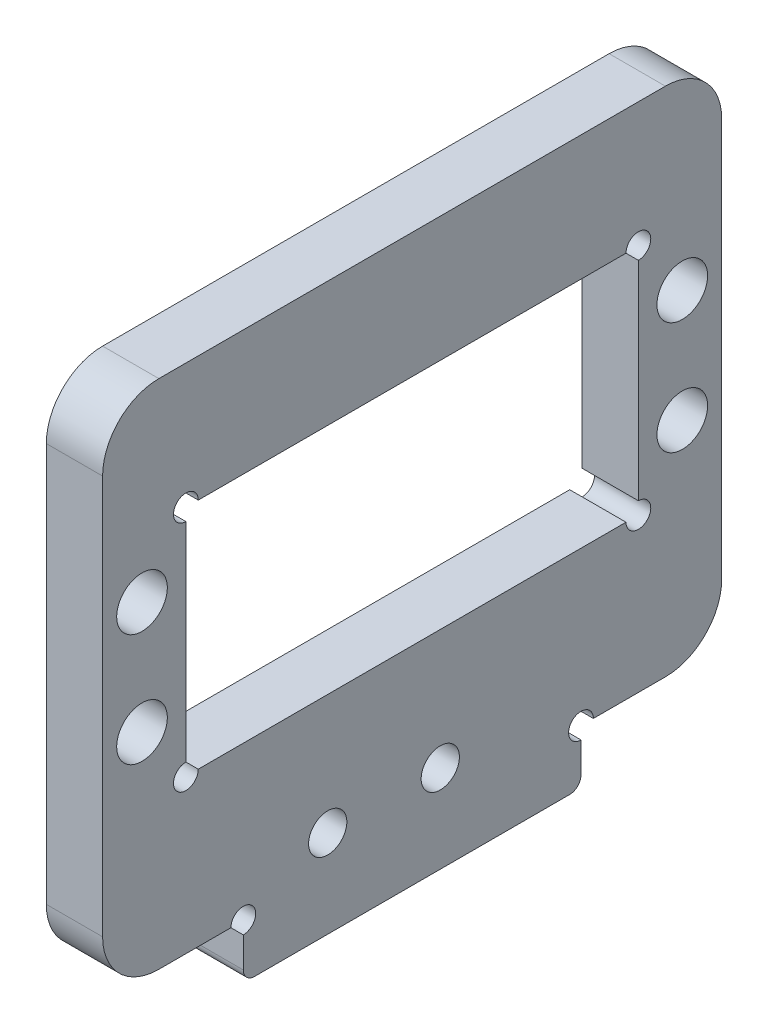
ISO-10303-21;
HEADER;
FILE_DESCRIPTION(('STEP AP214'),'2;1');
FILE_NAME('part.step','',(''),(''),'','','');
FILE_SCHEMA(('AUTOMOTIVE_DESIGN { 1 0 10303 214 1 1 1 1 }'));
ENDSEC;
DATA;
#1=APPLICATION_CONTEXT('core data for automotive mechanical design processes');
#2=APPLICATION_PROTOCOL_DEFINITION('international standard','automotive_design',2000,#1);
#3=PRODUCT_CONTEXT('',#1,'mechanical');
#4=PRODUCT('Part','Part','',(#3));
#5=PRODUCT_RELATED_PRODUCT_CATEGORY('part','',(#4));
#6=PRODUCT_DEFINITION_FORMATION('','',#4);
#7=PRODUCT_DEFINITION_CONTEXT('part definition',#1,'design');
#8=PRODUCT_DEFINITION('design','',#6,#7);
#9=PRODUCT_DEFINITION_SHAPE('','',#8);
#10=(LENGTH_UNIT() NAMED_UNIT(*) SI_UNIT(.MILLI.,.METRE.));
#11=(NAMED_UNIT(*) PLANE_ANGLE_UNIT() SI_UNIT($,.RADIAN.));
#12=(NAMED_UNIT(*) SI_UNIT($,.STERADIAN.) SOLID_ANGLE_UNIT());
#13=UNCERTAINTY_MEASURE_WITH_UNIT(LENGTH_MEASURE(1.E-05),#10,'distance_accuracy_value','');
#14=(GEOMETRIC_REPRESENTATION_CONTEXT(3) GLOBAL_UNCERTAINTY_ASSIGNED_CONTEXT((#13)) GLOBAL_UNIT_ASSIGNED_CONTEXT((#10,
#11,#12)) REPRESENTATION_CONTEXT('',''));
#15=CARTESIAN_POINT('',(0.,0.,0.));
#16=DIRECTION('',(0.,0.,1.));
#17=DIRECTION('',(1.,0.,0.));
#18=AXIS2_PLACEMENT_3D('',#15,#16,#17);
#19=CARTESIAN_POINT('',(5.,0.,0.));
#20=DIRECTION('',(0.,1.,0.));
#21=DIRECTION('',(0.,0.,1.));
#22=AXIS2_PLACEMENT_3D('',#19,#20,#21);
#23=PLANE('',#22);
#24=DIRECTION('',(0.,0.,-1.));
#25=VECTOR('',#24,1.);
#26=CARTESIAN_POINT('',(5.,0.,0.));
#27=LINE('',#26,#25);
#28=CARTESIAN_POINT('',(5.,0.,-43.6));
#29=VERTEX_POINT('',#28);
#30=CARTESIAN_POINT('',(5.,0.,-50.));
#31=VERTEX_POINT('',#30);
#32=EDGE_CURVE('E241',#29,#31,#27,.T.);
#33=ORIENTED_EDGE('',*,*,#32,.F.);
#34=DIRECTION('',(1.,0.,0.));
#35=VECTOR('',#34,1.);
#36=CARTESIAN_POINT('',(0.,0.,-43.6));
#37=LINE('',#36,#35);
#38=CARTESIAN_POINT('',(0.,0.,-43.6));
#39=VERTEX_POINT('',#38);
#40=EDGE_CURVE('E232',#29,#39,#37,.F.);
#41=ORIENTED_EDGE('',*,*,#40,.T.);
#42=DIRECTION('',(0.,0.,-1.));
#43=VECTOR('',#42,1.);
#44=CARTESIAN_POINT('',(0.,0.,0.));
#45=LINE('',#44,#43);
#46=CARTESIAN_POINT('',(0.,0.,-50.));
#47=VERTEX_POINT('',#46);
#48=EDGE_CURVE('E256',#39,#47,#45,.T.);
#49=ORIENTED_EDGE('',*,*,#48,.T.);
#50=DIRECTION('',(-1.,0.,0.));
#51=VECTOR('',#50,1.);
#52=CARTESIAN_POINT('',(5.,0.,-50.));
#53=LINE('',#52,#51);
#54=EDGE_CURVE('E278',#47,#31,#53,.F.);
#55=ORIENTED_EDGE('',*,*,#54,.T.);
#56=EDGE_LOOP('',(#33,#41,#49,#55));
#57=FACE_BOUND('',#56,.T.);
#58=ADVANCED_FACE('F45',(#57),#23,.F.);
#59=CARTESIAN_POINT('',(5.,0.,0.));
#60=DIRECTION('',(-1.,0.,0.));
#61=DIRECTION('',(0.,0.,1.));
#62=AXIS2_PLACEMENT_3D('',#59,#60,#61);
#63=PLANE('',#62);
#64=CARTESIAN_POINT('',(5.,29.,-51.5));
#65=DIRECTION('',(-1.,0.,0.));
#66=DIRECTION('',(0.,0.,1.));
#67=AXIS2_PLACEMENT_3D('',#64,#65,#66);
#68=CIRCLE('',#67,2.25);
#69=CARTESIAN_POINT('',(5.,29.,-49.25));
#70=VERTEX_POINT('',#69);
#71=EDGE_CURVE('E543',#70,#70,#68,.T.);
#72=ORIENTED_EDGE('',*,*,#71,.T.);
#73=EDGE_LOOP('',(#72));
#74=FACE_BOUND('',#73,.T.);
#75=CARTESIAN_POINT('',(5.,19.,-3.5));
#76=DIRECTION('',(-1.,0.,0.));
#77=DIRECTION('',(0.,0.,1.));
#78=AXIS2_PLACEMENT_3D('',#75,#76,#77);
#79=CIRCLE('',#78,2.25);
#80=CARTESIAN_POINT('',(5.,19.,-1.25));
#81=VERTEX_POINT('',#80);
#82=EDGE_CURVE('E537',#81,#81,#79,.T.);
#83=ORIENTED_EDGE('',*,*,#82,.T.);
#84=EDGE_LOOP('',(#83));
#85=FACE_BOUND('',#84,.T.);
#86=CARTESIAN_POINT('',(5.,19.,-51.5));
#87=DIRECTION('',(-1.,0.,0.));
#88=DIRECTION('',(0.,0.,1.));
#89=AXIS2_PLACEMENT_3D('',#86,#87,#88);
#90=CIRCLE('',#89,2.25);
#91=CARTESIAN_POINT('',(5.,19.,-49.25));
#92=VERTEX_POINT('',#91);
#93=EDGE_CURVE('E531',#92,#92,#90,.T.);
#94=ORIENTED_EDGE('',*,*,#93,.T.);
#95=EDGE_LOOP('',(#94));
#96=FACE_BOUND('',#95,.T.);
#97=CARTESIAN_POINT('',(5.,29.,-3.5));
#98=DIRECTION('',(-1.,0.,0.));
#99=DIRECTION('',(0.,0.,1.));
#100=AXIS2_PLACEMENT_3D('',#97,#98,#99);
#101=CIRCLE('',#100,2.25);
#102=CARTESIAN_POINT('',(5.,29.,-1.25));
#103=VERTEX_POINT('',#102);
#104=EDGE_CURVE('E525',#103,#103,#101,.T.);
#105=ORIENTED_EDGE('',*,*,#104,.T.);
#106=EDGE_LOOP('',(#105));
#107=FACE_BOUND('',#106,.T.);
#108=CARTESIAN_POINT('',(5.,3.00000000000002,-20.));
#109=DIRECTION('',(-1.,0.,0.));
#110=DIRECTION('',(0.,0.,1.));
#111=AXIS2_PLACEMENT_3D('',#108,#109,#110);
#112=CIRCLE('',#111,1.69999999999999);
#113=CARTESIAN_POINT('',(5.,3.00000000000002,-18.3));
#114=VERTEX_POINT('',#113);
#115=EDGE_CURVE('E519',#114,#114,#112,.T.);
#116=ORIENTED_EDGE('',*,*,#115,.T.);
#117=EDGE_LOOP('',(#116));
#118=FACE_BOUND('',#117,.T.);
#119=CARTESIAN_POINT('',(5.,3.00000000000002,-30.));
#120=DIRECTION('',(-1.,0.,0.));
#121=DIRECTION('',(0.,0.,1.));
#122=AXIS2_PLACEMENT_3D('',#119,#120,#121);
#123=CIRCLE('',#122,1.69999999999999);
#124=CARTESIAN_POINT('',(5.,3.00000000000002,-28.3));
#125=VERTEX_POINT('',#124);
#126=EDGE_CURVE('E512',#125,#125,#123,.T.);
#127=ORIENTED_EDGE('',*,*,#126,.T.);
#128=EDGE_LOOP('',(#127));
#129=FACE_BOUND('',#128,.T.);
#130=DIRECTION('',(0.,0.,-1.));
#131=VECTOR('',#130,1.);
#132=CARTESIAN_POINT('',(5.,-4.8,0.));
#133=LINE('',#132,#131);
#134=CARTESIAN_POINT('',(5.,-4.8,-13.5));
#135=VERTEX_POINT('',#134);
#136=CARTESIAN_POINT('',(5.,-4.8,-41.5));
#137=VERTEX_POINT('',#136);
#138=EDGE_CURVE('E342',#135,#137,#133,.T.);
#139=ORIENTED_EDGE('',*,*,#138,.T.);
#140=CARTESIAN_POINT('',(5.,-3.8,-41.5));
#141=DIRECTION('',(-1.,0.,0.));
#142=DIRECTION('',(0.,0.,1.));
#143=AXIS2_PLACEMENT_3D('',#140,#141,#142);
#144=CIRCLE('',#143,1.);
#145=CARTESIAN_POINT('',(5.,-3.8,-42.5));
#146=VERTEX_POINT('',#145);
#147=EDGE_CURVE('E319',#137,#146,#144,.F.);
#148=ORIENTED_EDGE('',*,*,#147,.T.);
#149=DIRECTION('',(0.,-1.,0.));
#150=VECTOR('',#149,1.);
#151=CARTESIAN_POINT('',(5.,0.,-42.5));
#152=LINE('',#151,#150);
#153=CARTESIAN_POINT('',(5.,-1.1,-42.5));
#154=VERTEX_POINT('',#153);
#155=EDGE_CURVE('E341',#154,#146,#152,.T.);
#156=ORIENTED_EDGE('',*,*,#155,.F.);
#157=CARTESIAN_POINT('',(5.,0.,-42.5));
#158=DIRECTION('',(1.,0.,0.));
#159=DIRECTION('',(0.,0.,-1.));
#160=AXIS2_PLACEMENT_3D('',#157,#158,#159);
#161=CIRCLE('',#160,1.1);
#162=EDGE_CURVE('E221',#29,#154,#161,.T.);
#163=ORIENTED_EDGE('',*,*,#162,.F.);
#164=ORIENTED_EDGE('',*,*,#32,.T.);
#165=CARTESIAN_POINT('',(5.,5.,-50.));
#166=DIRECTION('',(-1.,0.,0.));
#167=DIRECTION('',(0.,0.,1.));
#168=AXIS2_PLACEMENT_3D('',#165,#166,#167);
#169=CIRCLE('',#168,5.);
#170=CARTESIAN_POINT('',(5.,5.,-55.));
#171=VERTEX_POINT('',#170);
#172=EDGE_CURVE('E286',#31,#171,#169,.F.);
#173=ORIENTED_EDGE('',*,*,#172,.T.);
#174=DIRECTION('',(0.,1.,0.));
#175=VECTOR('',#174,1.);
#176=CARTESIAN_POINT('',(5.,0.,-55.));
#177=LINE('',#176,#175);
#178=CARTESIAN_POINT('',(5.,40.45,-55.));
#179=VERTEX_POINT('',#178);
#180=EDGE_CURVE('E240',#171,#179,#177,.T.);
#181=ORIENTED_EDGE('',*,*,#180,.T.);
#182=CARTESIAN_POINT('',(5.,40.45,-50.));
#183=DIRECTION('',(-1.,0.,0.));
#184=DIRECTION('',(0.,0.,1.));
#185=AXIS2_PLACEMENT_3D('',#182,#183,#184);
#186=CIRCLE('',#185,5.);
#187=CARTESIAN_POINT('',(5.,45.45,-50.));
#188=VERTEX_POINT('',#187);
#189=EDGE_CURVE('E284',#179,#188,#186,.F.);
#190=ORIENTED_EDGE('',*,*,#189,.T.);
#191=DIRECTION('',(0.,0.,1.));
#192=VECTOR('',#191,1.);
#193=CARTESIAN_POINT('',(5.,45.45,0.));
#194=LINE('',#193,#192);
#195=CARTESIAN_POINT('',(5.,45.45,-5.));
#196=VERTEX_POINT('',#195);
#197=EDGE_CURVE('E244',#188,#196,#194,.T.);
#198=ORIENTED_EDGE('',*,*,#197,.T.);
#199=CARTESIAN_POINT('',(5.,40.45,-5.));
#200=DIRECTION('',(-1.,0.,0.));
#201=DIRECTION('',(0.,0.,1.));
#202=AXIS2_PLACEMENT_3D('',#199,#200,#201);
#203=CIRCLE('',#202,5.);
#204=CARTESIAN_POINT('',(5.,40.45,0.));
#205=VERTEX_POINT('',#204);
#206=EDGE_CURVE('E281',#196,#205,#203,.F.);
#207=ORIENTED_EDGE('',*,*,#206,.T.);
#208=DIRECTION('',(0.,-1.,0.));
#209=VECTOR('',#208,1.);
#210=CARTESIAN_POINT('',(5.,0.,0.));
#211=LINE('',#210,#209);
#212=CARTESIAN_POINT('',(5.,5.,0.));
#213=VERTEX_POINT('',#212);
#214=EDGE_CURVE('E246',#205,#213,#211,.T.);
#215=ORIENTED_EDGE('',*,*,#214,.T.);
#216=CARTESIAN_POINT('',(5.,5.,-5.));
#217=DIRECTION('',(-1.,0.,0.));
#218=DIRECTION('',(0.,0.,1.));
#219=AXIS2_PLACEMENT_3D('',#216,#217,#218);
#220=CIRCLE('',#219,5.);
#221=CARTESIAN_POINT('',(5.,0.,-5.));
#222=VERTEX_POINT('',#221);
#223=EDGE_CURVE('E239',#213,#222,#220,.F.);
#224=ORIENTED_EDGE('',*,*,#223,.T.);
#225=CARTESIAN_POINT('',(5.,0.,-11.4));
#226=VERTEX_POINT('',#225);
#227=EDGE_CURVE('E228',#222,#226,#27,.T.);
#228=ORIENTED_EDGE('',*,*,#227,.T.);
#229=CARTESIAN_POINT('',(5.,0.,-12.5));
#230=DIRECTION('',(1.,0.,0.));
#231=DIRECTION('',(0.,0.,-1.));
#232=AXIS2_PLACEMENT_3D('',#229,#230,#231);
#233=CIRCLE('',#232,1.1);
#234=CARTESIAN_POINT('',(5.,-1.1,-12.5));
#235=VERTEX_POINT('',#234);
#236=EDGE_CURVE('E209',#235,#226,#233,.T.);
#237=ORIENTED_EDGE('',*,*,#236,.F.);
#238=DIRECTION('',(0.,-1.,0.));
#239=VECTOR('',#238,1.);
#240=CARTESIAN_POINT('',(5.,0.,-12.5));
#241=LINE('',#240,#239);
#242=CARTESIAN_POINT('',(5.,-3.8,-12.5));
#243=VERTEX_POINT('',#242);
#244=EDGE_CURVE('E344',#235,#243,#241,.T.);
#245=ORIENTED_EDGE('',*,*,#244,.T.);
#246=CARTESIAN_POINT('',(5.,-3.8,-13.5));
#247=DIRECTION('',(-1.,0.,0.));
#248=DIRECTION('',(0.,0.,1.));
#249=AXIS2_PLACEMENT_3D('',#246,#247,#248);
#250=CIRCLE('',#249,1.);
#251=EDGE_CURVE('E317',#243,#135,#250,.F.);
#252=ORIENTED_EDGE('',*,*,#251,.T.);
#253=EDGE_LOOP('',(#139,#148,#156,#163,#164,#173,#181,#190,#198,#207,#215,#224,#228,#237,#245,#252));
#254=FACE_BOUND('',#253,.T.);
#255=DIRECTION('',(0.,0.,-1.));
#256=VECTOR('',#255,1.);
#257=CARTESIAN_POINT('',(5.,13.65,-7.4));
#258=LINE('',#257,#256);
#259=CARTESIAN_POINT('',(5.,13.65,-8.5));
#260=VERTEX_POINT('',#259);
#261=CARTESIAN_POINT('',(5.,13.65,-46.5));
#262=VERTEX_POINT('',#261);
#263=EDGE_CURVE('E356',#260,#262,#258,.T.);
#264=ORIENTED_EDGE('',*,*,#263,.F.);
#265=CARTESIAN_POINT('',(5.,13.65,-7.4));
#266=DIRECTION('',(1.,0.,0.));
#267=DIRECTION('',(0.,0.,-1.));
#268=AXIS2_PLACEMENT_3D('',#265,#266,#267);
#269=CIRCLE('',#268,1.1);
#270=CARTESIAN_POINT('',(5.,14.75,-7.4));
#271=VERTEX_POINT('',#270);
#272=EDGE_CURVE('E396',#271,#260,#269,.T.);
#273=ORIENTED_EDGE('',*,*,#272,.F.);
#274=DIRECTION('',(0.,-1.,0.));
#275=VECTOR('',#274,1.);
#276=CARTESIAN_POINT('',(5.,34.35,-7.4));
#277=LINE('',#276,#275);
#278=CARTESIAN_POINT('',(5.,33.25,-7.4));
#279=VERTEX_POINT('',#278);
#280=EDGE_CURVE('E353',#279,#271,#277,.T.);
#281=ORIENTED_EDGE('',*,*,#280,.F.);
#282=CARTESIAN_POINT('',(5.,34.35,-7.4));
#283=DIRECTION('',(1.,0.,0.));
#284=DIRECTION('',(0.,0.,-1.));
#285=AXIS2_PLACEMENT_3D('',#282,#283,#284);
#286=CIRCLE('',#285,1.1);
#287=CARTESIAN_POINT('',(5.,34.35,-8.5));
#288=VERTEX_POINT('',#287);
#289=EDGE_CURVE('E388',#288,#279,#286,.T.);
#290=ORIENTED_EDGE('',*,*,#289,.F.);
#291=DIRECTION('',(0.,0.,1.));
#292=VECTOR('',#291,1.);
#293=CARTESIAN_POINT('',(5.,34.35,-7.4));
#294=LINE('',#293,#292);
#295=CARTESIAN_POINT('',(5.,34.35,-46.5));
#296=VERTEX_POINT('',#295);
#297=EDGE_CURVE('E257',#296,#288,#294,.T.);
#298=ORIENTED_EDGE('',*,*,#297,.F.);
#299=CARTESIAN_POINT('',(5.,34.35,-47.6));
#300=DIRECTION('',(1.,0.,0.));
#301=DIRECTION('',(0.,0.,-1.));
#302=AXIS2_PLACEMENT_3D('',#299,#300,#301);
#303=CIRCLE('',#302,1.1);
#304=CARTESIAN_POINT('',(5.,33.25,-47.6));
#305=VERTEX_POINT('',#304);
#306=EDGE_CURVE('E398',#305,#296,#303,.T.);
#307=ORIENTED_EDGE('',*,*,#306,.F.);
#308=DIRECTION('',(0.,1.,0.));
#309=VECTOR('',#308,1.);
#310=CARTESIAN_POINT('',(5.,34.35,-47.6));
#311=LINE('',#310,#309);
#312=CARTESIAN_POINT('',(5.,14.75,-47.6));
#313=VERTEX_POINT('',#312);
#314=EDGE_CURVE('E360',#313,#305,#311,.T.);
#315=ORIENTED_EDGE('',*,*,#314,.F.);
#316=CARTESIAN_POINT('',(5.,13.65,-47.6));
#317=DIRECTION('',(1.,0.,0.));
#318=DIRECTION('',(0.,0.,-1.));
#319=AXIS2_PLACEMENT_3D('',#316,#317,#318);
#320=CIRCLE('',#319,1.1);
#321=EDGE_CURVE('E404',#262,#313,#320,.T.);
#322=ORIENTED_EDGE('',*,*,#321,.F.);
#323=EDGE_LOOP('',(#264,#273,#281,#290,#298,#307,#315,#322));
#324=FACE_BOUND('',#323,.T.);
#325=ADVANCED_FACE('F235',(#74,#85,#96,#107,#118,#129,#254,#324),#63,.F.);
#326=CARTESIAN_POINT('',(0.,0.,0.));
#327=DIRECTION('',(-1.,0.,0.));
#328=DIRECTION('',(0.,0.,1.));
#329=AXIS2_PLACEMENT_3D('',#326,#327,#328);
#330=PLANE('',#329);
#331=CARTESIAN_POINT('',(0.,29.,-51.5));
#332=DIRECTION('',(-1.,0.,0.));
#333=DIRECTION('',(0.,0.,1.));
#334=AXIS2_PLACEMENT_3D('',#331,#332,#333);
#335=CIRCLE('',#334,2.24999999999999);
#336=CARTESIAN_POINT('',(0.,29.,-49.25));
#337=VERTEX_POINT('',#336);
#338=EDGE_CURVE('E546',#337,#337,#335,.T.);
#339=ORIENTED_EDGE('',*,*,#338,.F.);
#340=EDGE_LOOP('',(#339));
#341=FACE_BOUND('',#340,.T.);
#342=CARTESIAN_POINT('',(0.,19.,-3.5));
#343=DIRECTION('',(-1.,0.,0.));
#344=DIRECTION('',(0.,0.,1.));
#345=AXIS2_PLACEMENT_3D('',#342,#343,#344);
#346=CIRCLE('',#345,2.24999999999999);
#347=CARTESIAN_POINT('',(0.,19.,-1.25000000000002));
#348=VERTEX_POINT('',#347);
#349=EDGE_CURVE('E540',#348,#348,#346,.T.);
#350=ORIENTED_EDGE('',*,*,#349,.F.);
#351=EDGE_LOOP('',(#350));
#352=FACE_BOUND('',#351,.T.);
#353=CARTESIAN_POINT('',(0.,19.,-51.5));
#354=DIRECTION('',(-1.,0.,0.));
#355=DIRECTION('',(0.,0.,1.));
#356=AXIS2_PLACEMENT_3D('',#353,#354,#355);
#357=CIRCLE('',#356,2.24999999999999);
#358=CARTESIAN_POINT('',(0.,19.,-49.25));
#359=VERTEX_POINT('',#358);
#360=EDGE_CURVE('E534',#359,#359,#357,.T.);
#361=ORIENTED_EDGE('',*,*,#360,.F.);
#362=EDGE_LOOP('',(#361));
#363=FACE_BOUND('',#362,.T.);
#364=CARTESIAN_POINT('',(0.,29.,-3.5));
#365=DIRECTION('',(-1.,0.,0.));
#366=DIRECTION('',(0.,0.,1.));
#367=AXIS2_PLACEMENT_3D('',#364,#365,#366);
#368=CIRCLE('',#367,2.24999999999999);
#369=CARTESIAN_POINT('',(0.,29.,-1.25000000000002));
#370=VERTEX_POINT('',#369);
#371=EDGE_CURVE('E528',#370,#370,#368,.T.);
#372=ORIENTED_EDGE('',*,*,#371,.F.);
#373=EDGE_LOOP('',(#372));
#374=FACE_BOUND('',#373,.T.);
#375=CARTESIAN_POINT('',(0.,3.00000000000002,-20.));
#376=DIRECTION('',(-1.,0.,0.));
#377=DIRECTION('',(0.,0.,1.));
#378=AXIS2_PLACEMENT_3D('',#375,#376,#377);
#379=CIRCLE('',#378,1.69999999999999);
#380=CARTESIAN_POINT('',(0.,3.00000000000002,-18.3));
#381=VERTEX_POINT('',#380);
#382=EDGE_CURVE('E522',#381,#381,#379,.T.);
#383=ORIENTED_EDGE('',*,*,#382,.F.);
#384=EDGE_LOOP('',(#383));
#385=FACE_BOUND('',#384,.T.);
#386=CARTESIAN_POINT('',(0.,3.00000000000002,-30.));
#387=DIRECTION('',(-1.,0.,0.));
#388=DIRECTION('',(0.,0.,1.));
#389=AXIS2_PLACEMENT_3D('',#386,#387,#388);
#390=CIRCLE('',#389,1.69999999999999);
#391=CARTESIAN_POINT('',(0.,3.00000000000002,-28.3));
#392=VERTEX_POINT('',#391);
#393=EDGE_CURVE('E516',#392,#392,#390,.T.);
#394=ORIENTED_EDGE('',*,*,#393,.F.);
#395=EDGE_LOOP('',(#394));
#396=FACE_BOUND('',#395,.T.);
#397=DIRECTION('',(0.,-1.,0.));
#398=VECTOR('',#397,1.);
#399=CARTESIAN_POINT('',(0.,0.,-42.5));
#400=LINE('',#399,#398);
#401=CARTESIAN_POINT('',(0.,-1.1,-42.5));
#402=VERTEX_POINT('',#401);
#403=CARTESIAN_POINT('',(0.,-3.8,-42.5));
#404=VERTEX_POINT('',#403);
#405=EDGE_CURVE('E328',#402,#404,#400,.T.);
#406=ORIENTED_EDGE('',*,*,#405,.T.);
#407=CARTESIAN_POINT('',(0.,-3.8,-41.5));
#408=DIRECTION('',(-1.,0.,0.));
#409=DIRECTION('',(0.,0.,1.));
#410=AXIS2_PLACEMENT_3D('',#407,#408,#409);
#411=CIRCLE('',#410,1.);
#412=CARTESIAN_POINT('',(0.,-4.8,-41.5));
#413=VERTEX_POINT('',#412);
#414=EDGE_CURVE('E53',#404,#413,#411,.T.);
#415=ORIENTED_EDGE('',*,*,#414,.T.);
#416=DIRECTION('',(0.,0.,-1.));
#417=VECTOR('',#416,1.);
#418=CARTESIAN_POINT('',(0.,-4.8,0.));
#419=LINE('',#418,#417);
#420=CARTESIAN_POINT('',(0.,-4.8,-13.5));
#421=VERTEX_POINT('',#420);
#422=EDGE_CURVE('E326',#421,#413,#419,.T.);
#423=ORIENTED_EDGE('',*,*,#422,.F.);
#424=CARTESIAN_POINT('',(0.,-3.8,-13.5));
#425=DIRECTION('',(-1.,0.,0.));
#426=DIRECTION('',(0.,0.,1.));
#427=AXIS2_PLACEMENT_3D('',#424,#425,#426);
#428=CIRCLE('',#427,1.);
#429=CARTESIAN_POINT('',(0.,-3.8,-12.5));
#430=VERTEX_POINT('',#429);
#431=EDGE_CURVE('E60',#421,#430,#428,.T.);
#432=ORIENTED_EDGE('',*,*,#431,.T.);
#433=DIRECTION('',(0.,-1.,0.));
#434=VECTOR('',#433,1.);
#435=CARTESIAN_POINT('',(0.,0.,-12.5));
#436=LINE('',#435,#434);
#437=CARTESIAN_POINT('',(0.,-1.1,-12.5));
#438=VERTEX_POINT('',#437);
#439=EDGE_CURVE('E336',#438,#430,#436,.T.);
#440=ORIENTED_EDGE('',*,*,#439,.F.);
#441=CARTESIAN_POINT('',(0.,0.,-12.5));
#442=DIRECTION('',(1.,0.,0.));
#443=DIRECTION('',(0.,0.,-1.));
#444=AXIS2_PLACEMENT_3D('',#441,#442,#443);
#445=CIRCLE('',#444,1.1);
#446=CARTESIAN_POINT('',(0.,0.,-11.4));
#447=VERTEX_POINT('',#446);
#448=EDGE_CURVE('E220',#438,#447,#445,.T.);
#449=ORIENTED_EDGE('',*,*,#448,.T.);
#450=CARTESIAN_POINT('',(0.,0.,-5.));
#451=VERTEX_POINT('',#450);
#452=EDGE_CURVE('E231',#451,#447,#45,.T.);
#453=ORIENTED_EDGE('',*,*,#452,.F.);
#454=CARTESIAN_POINT('',(0.,5.,-5.));
#455=DIRECTION('',(-1.,0.,0.));
#456=DIRECTION('',(0.,0.,1.));
#457=AXIS2_PLACEMENT_3D('',#454,#455,#456);
#458=CIRCLE('',#457,5.);
#459=CARTESIAN_POINT('',(0.,5.,0.));
#460=VERTEX_POINT('',#459);
#461=EDGE_CURVE('E271',#451,#460,#458,.T.);
#462=ORIENTED_EDGE('',*,*,#461,.T.);
#463=DIRECTION('',(0.,-1.,0.));
#464=VECTOR('',#463,1.);
#465=CARTESIAN_POINT('',(0.,0.,0.));
#466=LINE('',#465,#464);
#467=CARTESIAN_POINT('',(0.,40.45,0.));
#468=VERTEX_POINT('',#467);
#469=EDGE_CURVE('E253',#468,#460,#466,.T.);
#470=ORIENTED_EDGE('',*,*,#469,.F.);
#471=CARTESIAN_POINT('',(0.,40.45,-5.));
#472=DIRECTION('',(-1.,0.,0.));
#473=DIRECTION('',(0.,0.,1.));
#474=AXIS2_PLACEMENT_3D('',#471,#472,#473);
#475=CIRCLE('',#474,5.);
#476=CARTESIAN_POINT('',(0.,45.45,-5.));
#477=VERTEX_POINT('',#476);
#478=EDGE_CURVE('E269',#468,#477,#475,.T.);
#479=ORIENTED_EDGE('',*,*,#478,.T.);
#480=DIRECTION('',(0.,0.,1.));
#481=VECTOR('',#480,1.);
#482=CARTESIAN_POINT('',(0.,45.45,0.));
#483=LINE('',#482,#481);
#484=CARTESIAN_POINT('',(0.,45.45,-50.));
#485=VERTEX_POINT('',#484);
#486=EDGE_CURVE('E262',#485,#477,#483,.T.);
#487=ORIENTED_EDGE('',*,*,#486,.F.);
#488=CARTESIAN_POINT('',(0.,40.45,-50.));
#489=DIRECTION('',(-1.,0.,0.));
#490=DIRECTION('',(0.,0.,1.));
#491=AXIS2_PLACEMENT_3D('',#488,#489,#490);
#492=CIRCLE('',#491,5.);
#493=CARTESIAN_POINT('',(0.,40.45,-55.));
#494=VERTEX_POINT('',#493);
#495=EDGE_CURVE('E273',#485,#494,#492,.T.);
#496=ORIENTED_EDGE('',*,*,#495,.T.);
#497=DIRECTION('',(0.,1.,0.));
#498=VECTOR('',#497,1.);
#499=CARTESIAN_POINT('',(0.,0.,-55.));
#500=LINE('',#499,#498);
#501=CARTESIAN_POINT('',(0.,5.,-55.));
#502=VERTEX_POINT('',#501);
#503=EDGE_CURVE('E259',#502,#494,#500,.T.);
#504=ORIENTED_EDGE('',*,*,#503,.F.);
#505=CARTESIAN_POINT('',(0.,5.,-50.));
#506=DIRECTION('',(-1.,0.,0.));
#507=DIRECTION('',(0.,0.,1.));
#508=AXIS2_PLACEMENT_3D('',#505,#506,#507);
#509=CIRCLE('',#508,5.);
#510=EDGE_CURVE('E275',#502,#47,#509,.T.);
#511=ORIENTED_EDGE('',*,*,#510,.T.);
#512=ORIENTED_EDGE('',*,*,#48,.F.);
#513=CARTESIAN_POINT('',(0.,0.,-42.5));
#514=DIRECTION('',(1.,0.,0.));
#515=DIRECTION('',(0.,0.,-1.));
#516=AXIS2_PLACEMENT_3D('',#513,#514,#515);
#517=CIRCLE('',#516,1.1);
#518=EDGE_CURVE('E493',#39,#402,#517,.T.);
#519=ORIENTED_EDGE('',*,*,#518,.T.);
#520=EDGE_LOOP('',(#406,#415,#423,#432,#440,#449,#453,#462,#470,#479,#487,#496,#504,#511,#512,#519));
#521=FACE_BOUND('',#520,.T.);
#522=CARTESIAN_POINT('',(0.,13.65,-7.4));
#523=DIRECTION('',(1.,0.,0.));
#524=DIRECTION('',(0.,0.,-1.));
#525=AXIS2_PLACEMENT_3D('',#522,#523,#524);
#526=CIRCLE('',#525,1.1);
#527=CARTESIAN_POINT('',(0.,14.75,-7.4));
#528=VERTEX_POINT('',#527);
#529=CARTESIAN_POINT('',(0.,13.65,-8.5));
#530=VERTEX_POINT('',#529);
#531=EDGE_CURVE('E394',#528,#530,#526,.T.);
#532=ORIENTED_EDGE('',*,*,#531,.T.);
#533=DIRECTION('',(0.,0.,-1.));
#534=VECTOR('',#533,1.);
#535=CARTESIAN_POINT('',(0.,13.65,-7.4));
#536=LINE('',#535,#534);
#537=CARTESIAN_POINT('',(0.,13.65,-46.5));
#538=VERTEX_POINT('',#537);
#539=EDGE_CURVE('E367',#530,#538,#536,.T.);
#540=ORIENTED_EDGE('',*,*,#539,.T.);
#541=CARTESIAN_POINT('',(0.,13.65,-47.6));
#542=DIRECTION('',(1.,0.,0.));
#543=DIRECTION('',(0.,0.,-1.));
#544=AXIS2_PLACEMENT_3D('',#541,#542,#543);
#545=CIRCLE('',#544,1.1);
#546=CARTESIAN_POINT('',(0.,14.75,-47.6));
#547=VERTEX_POINT('',#546);
#548=EDGE_CURVE('E498',#538,#547,#545,.T.);
#549=ORIENTED_EDGE('',*,*,#548,.T.);
#550=DIRECTION('',(0.,1.,0.));
#551=VECTOR('',#550,1.);
#552=CARTESIAN_POINT('',(0.,34.35,-47.6));
#553=LINE('',#552,#551);
#554=CARTESIAN_POINT('',(0.,33.25,-47.6));
#555=VERTEX_POINT('',#554);
#556=EDGE_CURVE('E370',#547,#555,#553,.T.);
#557=ORIENTED_EDGE('',*,*,#556,.T.);
#558=CARTESIAN_POINT('',(0.,34.35,-47.6));
#559=DIRECTION('',(1.,0.,0.));
#560=DIRECTION('',(0.,0.,-1.));
#561=AXIS2_PLACEMENT_3D('',#558,#559,#560);
#562=CIRCLE('',#561,1.1);
#563=CARTESIAN_POINT('',(0.,34.35,-46.5));
#564=VERTEX_POINT('',#563);
#565=EDGE_CURVE('E379',#555,#564,#562,.T.);
#566=ORIENTED_EDGE('',*,*,#565,.T.);
#567=DIRECTION('',(0.,0.,1.));
#568=VECTOR('',#567,1.);
#569=CARTESIAN_POINT('',(0.,34.35,-7.4));
#570=LINE('',#569,#568);
#571=CARTESIAN_POINT('',(0.,34.35,-8.5));
#572=VERTEX_POINT('',#571);
#573=EDGE_CURVE('E357',#564,#572,#570,.T.);
#574=ORIENTED_EDGE('',*,*,#573,.T.);
#575=CARTESIAN_POINT('',(0.,34.35,-7.4));
#576=DIRECTION('',(1.,0.,0.));
#577=DIRECTION('',(0.,0.,-1.));
#578=AXIS2_PLACEMENT_3D('',#575,#576,#577);
#579=CIRCLE('',#578,1.1);
#580=CARTESIAN_POINT('',(0.,33.25,-7.4));
#581=VERTEX_POINT('',#580);
#582=EDGE_CURVE('E377',#572,#581,#579,.T.);
#583=ORIENTED_EDGE('',*,*,#582,.T.);
#584=DIRECTION('',(0.,-1.,0.));
#585=VECTOR('',#584,1.);
#586=CARTESIAN_POINT('',(0.,34.35,-7.4));
#587=LINE('',#586,#585);
#588=EDGE_CURVE('E335',#581,#528,#587,.T.);
#589=ORIENTED_EDGE('',*,*,#588,.T.);
#590=EDGE_LOOP('',(#532,#540,#549,#557,#566,#574,#583,#589));
#591=FACE_BOUND('',#590,.T.);
#592=ADVANCED_FACE('F324',(#341,#352,#363,#374,#385,#396,#521,#591),#330,.T.);
#593=CARTESIAN_POINT('',(5.,0.,0.));
#594=DIRECTION('',(0.,0.,-1.));
#595=DIRECTION('',(-1.,0.,0.));
#596=AXIS2_PLACEMENT_3D('',#593,#594,#595);
#597=PLANE('',#596);
#598=ORIENTED_EDGE('',*,*,#469,.T.);
#599=DIRECTION('',(-1.,0.,0.));
#600=VECTOR('',#599,1.);
#601=CARTESIAN_POINT('',(5.,5.,0.));
#602=LINE('',#601,#600);
#603=EDGE_CURVE('E298',#460,#213,#602,.F.);
#604=ORIENTED_EDGE('',*,*,#603,.T.);
#605=ORIENTED_EDGE('',*,*,#214,.F.);
#606=DIRECTION('',(-1.,0.,0.));
#607=VECTOR('',#606,1.);
#608=CARTESIAN_POINT('',(5.,40.45,0.));
#609=LINE('',#608,#607);
#610=EDGE_CURVE('E295',#205,#468,#609,.T.);
#611=ORIENTED_EDGE('',*,*,#610,.T.);
#612=EDGE_LOOP('',(#598,#604,#605,#611));
#613=FACE_BOUND('',#612,.T.);
#614=ADVANCED_FACE('F441',(#613),#597,.F.);
#615=ORIENTED_EDGE('',*,*,#452,.T.);
#616=DIRECTION('',(1.,0.,0.));
#617=VECTOR('',#616,1.);
#618=CARTESIAN_POINT('',(0.,0.,-11.4));
#619=LINE('',#618,#617);
#620=EDGE_CURVE('E212',#447,#226,#619,.T.);
#621=ORIENTED_EDGE('',*,*,#620,.T.);
#622=ORIENTED_EDGE('',*,*,#227,.F.);
#623=DIRECTION('',(-1.,0.,0.));
#624=VECTOR('',#623,1.);
#625=CARTESIAN_POINT('',(5.,0.,-5.));
#626=LINE('',#625,#624);
#627=EDGE_CURVE('E293',#222,#451,#626,.T.);
#628=ORIENTED_EDGE('',*,*,#627,.T.);
#629=EDGE_LOOP('',(#615,#621,#622,#628));
#630=FACE_BOUND('',#629,.T.);
#631=ADVANCED_FACE('F226',(#630),#23,.F.);
#632=CARTESIAN_POINT('',(5.,0.,-55.));
#633=DIRECTION('',(0.,0.,1.));
#634=DIRECTION('',(1.,0.,0.));
#635=AXIS2_PLACEMENT_3D('',#632,#633,#634);
#636=PLANE('',#635);
#637=ORIENTED_EDGE('',*,*,#180,.F.);
#638=DIRECTION('',(-1.,0.,0.));
#639=VECTOR('',#638,1.);
#640=CARTESIAN_POINT('',(5.,5.,-55.));
#641=LINE('',#640,#639);
#642=EDGE_CURVE('E266',#171,#502,#641,.T.);
#643=ORIENTED_EDGE('',*,*,#642,.T.);
#644=ORIENTED_EDGE('',*,*,#503,.T.);
#645=DIRECTION('',(-1.,0.,0.));
#646=VECTOR('',#645,1.);
#647=CARTESIAN_POINT('',(5.,40.45,-55.));
#648=LINE('',#647,#646);
#649=EDGE_CURVE('E252',#494,#179,#648,.F.);
#650=ORIENTED_EDGE('',*,*,#649,.T.);
#651=EDGE_LOOP('',(#637,#643,#644,#650));
#652=FACE_BOUND('',#651,.T.);
#653=ADVANCED_FACE('F440',(#652),#636,.F.);
#654=CARTESIAN_POINT('',(5.,45.45,0.));
#655=DIRECTION('',(0.,-1.,0.));
#656=DIRECTION('',(0.,0.,-1.));
#657=AXIS2_PLACEMENT_3D('',#654,#655,#656);
#658=PLANE('',#657);
#659=ORIENTED_EDGE('',*,*,#197,.F.);
#660=DIRECTION('',(-1.,0.,0.));
#661=VECTOR('',#660,1.);
#662=CARTESIAN_POINT('',(5.,45.45,-50.));
#663=LINE('',#662,#661);
#664=EDGE_CURVE('E290',#188,#485,#663,.T.);
#665=ORIENTED_EDGE('',*,*,#664,.T.);
#666=ORIENTED_EDGE('',*,*,#486,.T.);
#667=DIRECTION('',(-1.,0.,0.));
#668=VECTOR('',#667,1.);
#669=CARTESIAN_POINT('',(5.,45.45,-5.));
#670=LINE('',#669,#668);
#671=EDGE_CURVE('E288',#477,#196,#670,.F.);
#672=ORIENTED_EDGE('',*,*,#671,.T.);
#673=EDGE_LOOP('',(#659,#665,#666,#672));
#674=FACE_BOUND('',#673,.T.);
#675=ADVANCED_FACE('F446',(#674),#658,.F.);
#676=CARTESIAN_POINT('',(5.,34.35,-7.4));
#677=DIRECTION('',(0.,0.,-1.));
#678=DIRECTION('',(-1.,0.,0.));
#679=AXIS2_PLACEMENT_3D('',#676,#677,#678);
#680=PLANE('',#679);
#681=DIRECTION('',(1.,0.,0.));
#682=VECTOR('',#681,1.);
#683=CARTESIAN_POINT('',(0.,14.75,-7.4));
#684=LINE('',#683,#682);
#685=EDGE_CURVE('E345',#528,#271,#684,.T.);
#686=ORIENTED_EDGE('',*,*,#685,.F.);
#687=ORIENTED_EDGE('',*,*,#588,.F.);
#688=DIRECTION('',(1.,0.,0.));
#689=VECTOR('',#688,1.);
#690=CARTESIAN_POINT('',(0.,33.25,-7.4));
#691=LINE('',#690,#689);
#692=EDGE_CURVE('E410',#279,#581,#691,.F.);
#693=ORIENTED_EDGE('',*,*,#692,.F.);
#694=ORIENTED_EDGE('',*,*,#280,.T.);
#695=EDGE_LOOP('',(#686,#687,#693,#694));
#696=FACE_BOUND('',#695,.T.);
#697=ADVANCED_FACE('F603',(#696),#680,.T.);
#698=CARTESIAN_POINT('',(5.,13.65,-7.4));
#699=DIRECTION('',(0.,1.,0.));
#700=DIRECTION('',(0.,0.,1.));
#701=AXIS2_PLACEMENT_3D('',#698,#699,#700);
#702=PLANE('',#701);
#703=DIRECTION('',(1.,0.,0.));
#704=VECTOR('',#703,1.);
#705=CARTESIAN_POINT('',(0.,13.65,-8.5));
#706=LINE('',#705,#704);
#707=EDGE_CURVE('E310',#260,#530,#706,.F.);
#708=ORIENTED_EDGE('',*,*,#707,.F.);
#709=ORIENTED_EDGE('',*,*,#263,.T.);
#710=DIRECTION('',(1.,0.,0.));
#711=VECTOR('',#710,1.);
#712=CARTESIAN_POINT('',(0.,13.65,-46.5));
#713=LINE('',#712,#711);
#714=EDGE_CURVE('E348',#538,#262,#713,.T.);
#715=ORIENTED_EDGE('',*,*,#714,.F.);
#716=ORIENTED_EDGE('',*,*,#539,.F.);
#717=EDGE_LOOP('',(#708,#709,#715,#716));
#718=FACE_BOUND('',#717,.T.);
#719=ADVANCED_FACE('F505',(#718),#702,.T.);
#720=CARTESIAN_POINT('',(5.,34.35,-47.6));
#721=DIRECTION('',(0.,0.,1.));
#722=DIRECTION('',(1.,0.,0.));
#723=AXIS2_PLACEMENT_3D('',#720,#721,#722);
#724=PLANE('',#723);
#725=DIRECTION('',(1.,0.,0.));
#726=VECTOR('',#725,1.);
#727=CARTESIAN_POINT('',(0.,33.25,-47.6));
#728=LINE('',#727,#726);
#729=EDGE_CURVE('E408',#555,#305,#728,.T.);
#730=ORIENTED_EDGE('',*,*,#729,.F.);
#731=ORIENTED_EDGE('',*,*,#556,.F.);
#732=DIRECTION('',(1.,0.,0.));
#733=VECTOR('',#732,1.);
#734=CARTESIAN_POINT('',(0.,14.75,-47.6));
#735=LINE('',#734,#733);
#736=EDGE_CURVE('E308',#313,#547,#735,.F.);
#737=ORIENTED_EDGE('',*,*,#736,.F.);
#738=ORIENTED_EDGE('',*,*,#314,.T.);
#739=EDGE_LOOP('',(#730,#731,#737,#738));
#740=FACE_BOUND('',#739,.T.);
#741=ADVANCED_FACE('F597',(#740),#724,.T.);
#742=CARTESIAN_POINT('',(5.,34.35,-7.4));
#743=DIRECTION('',(0.,-1.,0.));
#744=DIRECTION('',(0.,0.,-1.));
#745=AXIS2_PLACEMENT_3D('',#742,#743,#744);
#746=PLANE('',#745);
#747=DIRECTION('',(1.,0.,0.));
#748=VECTOR('',#747,1.);
#749=CARTESIAN_POINT('',(0.,34.35,-8.5));
#750=LINE('',#749,#748);
#751=EDGE_CURVE('E306',#572,#288,#750,.T.);
#752=ORIENTED_EDGE('',*,*,#751,.F.);
#753=ORIENTED_EDGE('',*,*,#573,.F.);
#754=DIRECTION('',(1.,0.,0.));
#755=VECTOR('',#754,1.);
#756=CARTESIAN_POINT('',(0.,34.35,-46.5));
#757=LINE('',#756,#755);
#758=EDGE_CURVE('E304',#296,#564,#757,.F.);
#759=ORIENTED_EDGE('',*,*,#758,.F.);
#760=ORIENTED_EDGE('',*,*,#297,.T.);
#761=EDGE_LOOP('',(#752,#753,#759,#760));
#762=FACE_BOUND('',#761,.T.);
#763=ADVANCED_FACE('F383',(#762),#746,.T.);
#764=CARTESIAN_POINT('',(0.,0.,-42.5));
#765=DIRECTION('',(0.,0.,1.));
#766=DIRECTION('',(0.,-1.,0.));
#767=AXIS2_PLACEMENT_3D('',#764,#765,#766);
#768=PLANE('',#767);
#769=ORIENTED_EDGE('',*,*,#155,.T.);
#770=DIRECTION('',(1.,0.,0.));
#771=VECTOR('',#770,1.);
#772=CARTESIAN_POINT('',(0.,-3.8,-42.5));
#773=LINE('',#772,#771);
#774=EDGE_CURVE('E68',#146,#404,#773,.F.);
#775=ORIENTED_EDGE('',*,*,#774,.T.);
#776=ORIENTED_EDGE('',*,*,#405,.F.);
#777=DIRECTION('',(1.,0.,0.));
#778=VECTOR('',#777,1.);
#779=CARTESIAN_POINT('',(0.,-1.1,-42.5));
#780=LINE('',#779,#778);
#781=EDGE_CURVE('E301',#402,#154,#780,.T.);
#782=ORIENTED_EDGE('',*,*,#781,.T.);
#783=EDGE_LOOP('',(#769,#775,#776,#782));
#784=FACE_BOUND('',#783,.T.);
#785=ADVANCED_FACE('F343',(#784),#768,.F.);
#786=CARTESIAN_POINT('',(0.,-4.8,0.));
#787=DIRECTION('',(0.,-1.,0.));
#788=DIRECTION('',(0.,0.,-1.));
#789=AXIS2_PLACEMENT_3D('',#786,#787,#788);
#790=PLANE('',#789);
#791=ORIENTED_EDGE('',*,*,#422,.T.);
#792=DIRECTION('',(1.,0.,0.));
#793=VECTOR('',#792,1.);
#794=CARTESIAN_POINT('',(5.,-4.8,-41.5));
#795=LINE('',#794,#793);
#796=EDGE_CURVE('E314',#413,#137,#795,.T.);
#797=ORIENTED_EDGE('',*,*,#796,.T.);
#798=ORIENTED_EDGE('',*,*,#138,.F.);
#799=DIRECTION('',(1.,0.,0.));
#800=VECTOR('',#799,1.);
#801=CARTESIAN_POINT('',(0.,-4.8,-13.5));
#802=LINE('',#801,#800);
#803=EDGE_CURVE('E312',#135,#421,#802,.F.);
#804=ORIENTED_EDGE('',*,*,#803,.T.);
#805=EDGE_LOOP('',(#791,#797,#798,#804));
#806=FACE_BOUND('',#805,.T.);
#807=ADVANCED_FACE('F332',(#806),#790,.T.);
#808=CARTESIAN_POINT('',(0.,0.,-12.5));
#809=DIRECTION('',(0.,0.,1.));
#810=DIRECTION('',(1.,0.,0.));
#811=AXIS2_PLACEMENT_3D('',#808,#809,#810);
#812=PLANE('',#811);
#813=ORIENTED_EDGE('',*,*,#439,.T.);
#814=DIRECTION('',(1.,0.,0.));
#815=VECTOR('',#814,1.);
#816=CARTESIAN_POINT('',(0.,-3.8,-12.5));
#817=LINE('',#816,#815);
#818=EDGE_CURVE('E11',#430,#243,#817,.T.);
#819=ORIENTED_EDGE('',*,*,#818,.T.);
#820=ORIENTED_EDGE('',*,*,#244,.F.);
#821=DIRECTION('',(1.,0.,0.));
#822=VECTOR('',#821,1.);
#823=CARTESIAN_POINT('',(0.,-1.1,-12.5));
#824=LINE('',#823,#822);
#825=EDGE_CURVE('E215',#438,#235,#824,.T.);
#826=ORIENTED_EDGE('',*,*,#825,.F.);
#827=EDGE_LOOP('',(#813,#819,#820,#826));
#828=FACE_BOUND('',#827,.T.);
#829=ADVANCED_FACE('F415',(#828),#812,.T.);
#830=CARTESIAN_POINT('',(5.,5.,-50.));
#831=DIRECTION('',(-1.,0.,0.));
#832=DIRECTION('',(0.,0.,1.));
#833=AXIS2_PLACEMENT_3D('',#830,#831,#832);
#834=CYLINDRICAL_SURFACE('',#833,5.);
#835=ORIENTED_EDGE('',*,*,#172,.F.);
#836=ORIENTED_EDGE('',*,*,#54,.F.);
#837=ORIENTED_EDGE('',*,*,#510,.F.);
#838=ORIENTED_EDGE('',*,*,#642,.F.);
#839=EDGE_LOOP('',(#835,#836,#837,#838));
#840=FACE_BOUND('',#839,.T.);
#841=ADVANCED_FACE('F456',(#840),#834,.T.);
#842=CARTESIAN_POINT('',(5.,40.45,-50.));
#843=DIRECTION('',(-1.,0.,0.));
#844=DIRECTION('',(0.,0.,1.));
#845=AXIS2_PLACEMENT_3D('',#842,#843,#844);
#846=CYLINDRICAL_SURFACE('',#845,5.);
#847=ORIENTED_EDGE('',*,*,#189,.F.);
#848=ORIENTED_EDGE('',*,*,#649,.F.);
#849=ORIENTED_EDGE('',*,*,#495,.F.);
#850=ORIENTED_EDGE('',*,*,#664,.F.);
#851=EDGE_LOOP('',(#847,#848,#849,#850));
#852=FACE_BOUND('',#851,.T.);
#853=ADVANCED_FACE('F459',(#852),#846,.T.);
#854=CARTESIAN_POINT('',(5.,5.,-5.));
#855=DIRECTION('',(-1.,0.,0.));
#856=DIRECTION('',(0.,0.,1.));
#857=AXIS2_PLACEMENT_3D('',#854,#855,#856);
#858=CYLINDRICAL_SURFACE('',#857,5.);
#859=ORIENTED_EDGE('',*,*,#223,.F.);
#860=ORIENTED_EDGE('',*,*,#603,.F.);
#861=ORIENTED_EDGE('',*,*,#461,.F.);
#862=ORIENTED_EDGE('',*,*,#627,.F.);
#863=EDGE_LOOP('',(#859,#860,#861,#862));
#864=FACE_BOUND('',#863,.T.);
#865=ADVANCED_FACE('F463',(#864),#858,.T.);
#866=CARTESIAN_POINT('',(5.,40.45,-5.));
#867=DIRECTION('',(-1.,0.,0.));
#868=DIRECTION('',(0.,0.,1.));
#869=AXIS2_PLACEMENT_3D('',#866,#867,#868);
#870=CYLINDRICAL_SURFACE('',#869,5.);
#871=ORIENTED_EDGE('',*,*,#206,.F.);
#872=ORIENTED_EDGE('',*,*,#671,.F.);
#873=ORIENTED_EDGE('',*,*,#478,.F.);
#874=ORIENTED_EDGE('',*,*,#610,.F.);
#875=EDGE_LOOP('',(#871,#872,#873,#874));
#876=FACE_BOUND('',#875,.T.);
#877=ADVANCED_FACE('F467',(#876),#870,.T.);
#878=CARTESIAN_POINT('',(0.,0.,-12.5));
#879=DIRECTION('',(1.,0.,0.));
#880=DIRECTION('',(0.,0.,-1.));
#881=AXIS2_PLACEMENT_3D('',#878,#879,#880);
#882=CYLINDRICAL_SURFACE('',#881,1.1);
#883=ORIENTED_EDGE('',*,*,#448,.F.);
#884=ORIENTED_EDGE('',*,*,#825,.T.);
#885=ORIENTED_EDGE('',*,*,#236,.T.);
#886=ORIENTED_EDGE('',*,*,#620,.F.);
#887=EDGE_LOOP('',(#883,#884,#885,#886));
#888=FACE_BOUND('',#887,.T.);
#889=ADVANCED_FACE('F211',(#888),#882,.F.);
#890=CARTESIAN_POINT('',(0.,0.,-42.5));
#891=DIRECTION('',(1.,0.,0.));
#892=DIRECTION('',(0.,0.,-1.));
#893=AXIS2_PLACEMENT_3D('',#890,#891,#892);
#894=CYLINDRICAL_SURFACE('',#893,1.1);
#895=ORIENTED_EDGE('',*,*,#162,.T.);
#896=ORIENTED_EDGE('',*,*,#781,.F.);
#897=ORIENTED_EDGE('',*,*,#518,.F.);
#898=ORIENTED_EDGE('',*,*,#40,.F.);
#899=EDGE_LOOP('',(#895,#896,#897,#898));
#900=FACE_BOUND('',#899,.T.);
#901=ADVANCED_FACE('F473',(#900),#894,.F.);
#902=CARTESIAN_POINT('',(0.,34.35,-47.6));
#903=DIRECTION('',(1.,0.,0.));
#904=DIRECTION('',(0.,0.,-1.));
#905=AXIS2_PLACEMENT_3D('',#902,#903,#904);
#906=CYLINDRICAL_SURFACE('',#905,1.1);
#907=ORIENTED_EDGE('',*,*,#729,.T.);
#908=ORIENTED_EDGE('',*,*,#306,.T.);
#909=ORIENTED_EDGE('',*,*,#758,.T.);
#910=ORIENTED_EDGE('',*,*,#565,.F.);
#911=EDGE_LOOP('',(#907,#908,#909,#910));
#912=FACE_BOUND('',#911,.T.);
#913=ADVANCED_FACE('F581',(#912),#906,.F.);
#914=CARTESIAN_POINT('',(0.,34.35,-7.4));
#915=DIRECTION('',(1.,0.,0.));
#916=DIRECTION('',(0.,0.,-1.));
#917=AXIS2_PLACEMENT_3D('',#914,#915,#916);
#918=CYLINDRICAL_SURFACE('',#917,1.1);
#919=ORIENTED_EDGE('',*,*,#692,.T.);
#920=ORIENTED_EDGE('',*,*,#582,.F.);
#921=ORIENTED_EDGE('',*,*,#751,.T.);
#922=ORIENTED_EDGE('',*,*,#289,.T.);
#923=EDGE_LOOP('',(#919,#920,#921,#922));
#924=FACE_BOUND('',#923,.T.);
#925=ADVANCED_FACE('F387',(#924),#918,.F.);
#926=CARTESIAN_POINT('',(0.,13.65,-47.6));
#927=DIRECTION('',(1.,0.,0.));
#928=DIRECTION('',(0.,0.,-1.));
#929=AXIS2_PLACEMENT_3D('',#926,#927,#928);
#930=CYLINDRICAL_SURFACE('',#929,1.1);
#931=ORIENTED_EDGE('',*,*,#714,.T.);
#932=ORIENTED_EDGE('',*,*,#321,.T.);
#933=ORIENTED_EDGE('',*,*,#736,.T.);
#934=ORIENTED_EDGE('',*,*,#548,.F.);
#935=EDGE_LOOP('',(#931,#932,#933,#934));
#936=FACE_BOUND('',#935,.T.);
#937=ADVANCED_FACE('F576',(#936),#930,.F.);
#938=CARTESIAN_POINT('',(0.,13.65,-7.4));
#939=DIRECTION('',(1.,0.,0.));
#940=DIRECTION('',(0.,0.,-1.));
#941=AXIS2_PLACEMENT_3D('',#938,#939,#940);
#942=CYLINDRICAL_SURFACE('',#941,1.1);
#943=ORIENTED_EDGE('',*,*,#685,.T.);
#944=ORIENTED_EDGE('',*,*,#272,.T.);
#945=ORIENTED_EDGE('',*,*,#707,.T.);
#946=ORIENTED_EDGE('',*,*,#531,.F.);
#947=EDGE_LOOP('',(#943,#944,#945,#946));
#948=FACE_BOUND('',#947,.T.);
#949=ADVANCED_FACE('F426',(#948),#942,.F.);
#950=CARTESIAN_POINT('',(0.,-3.8,-41.5));
#951=DIRECTION('',(-1.,0.,0.));
#952=DIRECTION('',(0.,0.,1.));
#953=AXIS2_PLACEMENT_3D('',#950,#951,#952);
#954=CYLINDRICAL_SURFACE('',#953,1.);
#955=ORIENTED_EDGE('',*,*,#414,.F.);
#956=ORIENTED_EDGE('',*,*,#774,.F.);
#957=ORIENTED_EDGE('',*,*,#147,.F.);
#958=ORIENTED_EDGE('',*,*,#796,.F.);
#959=EDGE_LOOP('',(#955,#956,#957,#958));
#960=FACE_BOUND('',#959,.T.);
#961=ADVANCED_FACE('F338',(#960),#954,.T.);
#962=CARTESIAN_POINT('',(0.,-3.8,-13.5));
#963=DIRECTION('',(1.,0.,0.));
#964=DIRECTION('',(0.,0.,-1.));
#965=AXIS2_PLACEMENT_3D('',#962,#963,#964);
#966=CYLINDRICAL_SURFACE('',#965,1.);
#967=ORIENTED_EDGE('',*,*,#431,.F.);
#968=ORIENTED_EDGE('',*,*,#803,.F.);
#969=ORIENTED_EDGE('',*,*,#251,.F.);
#970=ORIENTED_EDGE('',*,*,#818,.F.);
#971=EDGE_LOOP('',(#967,#968,#969,#970));
#972=FACE_BOUND('',#971,.T.);
#973=ADVANCED_FACE('F47',(#972),#966,.T.);
#974=CARTESIAN_POINT('',(0.,3.00000000000002,-30.));
#975=DIRECTION('',(-1.,0.,0.));
#976=DIRECTION('',(0.,0.,1.));
#977=AXIS2_PLACEMENT_3D('',#974,#975,#976);
#978=CYLINDRICAL_SURFACE('',#977,1.69999999999999);
#979=ORIENTED_EDGE('',*,*,#126,.F.);
#980=EDGE_LOOP('',(#979));
#981=FACE_BOUND('',#980,.T.);
#982=ORIENTED_EDGE('',*,*,#393,.T.);
#983=EDGE_LOOP('',(#982));
#984=FACE_BOUND('',#983,.T.);
#985=ADVANCED_FACE('F418',(#981,#984),#978,.F.);
#986=CARTESIAN_POINT('',(0.,3.00000000000002,-20.));
#987=DIRECTION('',(-1.,0.,0.));
#988=DIRECTION('',(0.,0.,1.));
#989=AXIS2_PLACEMENT_3D('',#986,#987,#988);
#990=CYLINDRICAL_SURFACE('',#989,1.69999999999999);
#991=ORIENTED_EDGE('',*,*,#115,.F.);
#992=EDGE_LOOP('',(#991));
#993=FACE_BOUND('',#992,.T.);
#994=ORIENTED_EDGE('',*,*,#382,.T.);
#995=EDGE_LOOP('',(#994));
#996=FACE_BOUND('',#995,.T.);
#997=ADVANCED_FACE('F423',(#993,#996),#990,.F.);
#998=CARTESIAN_POINT('',(0.,29.,-3.5));
#999=DIRECTION('',(-1.,0.,0.));
#1000=DIRECTION('',(0.,0.,1.));
#1001=AXIS2_PLACEMENT_3D('',#998,#999,#1000);
#1002=CYLINDRICAL_SURFACE('',#1001,2.25);
#1003=ORIENTED_EDGE('',*,*,#104,.F.);
#1004=EDGE_LOOP('',(#1003));
#1005=FACE_BOUND('',#1004,.T.);
#1006=ORIENTED_EDGE('',*,*,#371,.T.);
#1007=EDGE_LOOP('',(#1006));
#1008=FACE_BOUND('',#1007,.T.);
#1009=ADVANCED_FACE('F564',(#1005,#1008),#1002,.F.);
#1010=CARTESIAN_POINT('',(0.,19.,-51.5));
#1011=DIRECTION('',(-1.,0.,0.));
#1012=DIRECTION('',(0.,0.,1.));
#1013=AXIS2_PLACEMENT_3D('',#1010,#1011,#1012);
#1014=CYLINDRICAL_SURFACE('',#1013,2.24999999999999);
#1015=ORIENTED_EDGE('',*,*,#93,.F.);
#1016=EDGE_LOOP('',(#1015));
#1017=FACE_BOUND('',#1016,.T.);
#1018=ORIENTED_EDGE('',*,*,#360,.T.);
#1019=EDGE_LOOP('',(#1018));
#1020=FACE_BOUND('',#1019,.T.);
#1021=ADVANCED_FACE('F570',(#1017,#1020),#1014,.F.);
#1022=CARTESIAN_POINT('',(0.,19.,-3.5));
#1023=DIRECTION('',(-1.,0.,0.));
#1024=DIRECTION('',(0.,0.,1.));
#1025=AXIS2_PLACEMENT_3D('',#1022,#1023,#1024);
#1026=CYLINDRICAL_SURFACE('',#1025,2.24999999999999);
#1027=ORIENTED_EDGE('',*,*,#82,.F.);
#1028=EDGE_LOOP('',(#1027));
#1029=FACE_BOUND('',#1028,.T.);
#1030=ORIENTED_EDGE('',*,*,#349,.T.);
#1031=EDGE_LOOP('',(#1030));
#1032=FACE_BOUND('',#1031,.T.);
#1033=ADVANCED_FACE('F704',(#1029,#1032),#1026,.F.);
#1034=CARTESIAN_POINT('',(0.,29.,-51.5));
#1035=DIRECTION('',(-1.,0.,0.));
#1036=DIRECTION('',(0.,0.,1.));
#1037=AXIS2_PLACEMENT_3D('',#1034,#1035,#1036);
#1038=CYLINDRICAL_SURFACE('',#1037,2.25);
#1039=ORIENTED_EDGE('',*,*,#71,.F.);
#1040=EDGE_LOOP('',(#1039));
#1041=FACE_BOUND('',#1040,.T.);
#1042=ORIENTED_EDGE('',*,*,#338,.T.);
#1043=EDGE_LOOP('',(#1042));
#1044=FACE_BOUND('',#1043,.T.);
#1045=ADVANCED_FACE('F550',(#1041,#1044),#1038,.F.);
#1046=CLOSED_SHELL('',(#58,#325,#592,#614,#631,#653,#675,#697,#719,#741,#763,#785,#807,#829,
#841,#853,#865,#877,#889,#901,#913,#925,#937,#949,#961,#973,#985,#997,#1009,#1021,#1033,#1045));
#1047=MANIFOLD_SOLID_BREP('B2',#1046);
#1048=ADVANCED_BREP_SHAPE_REPRESENTATION('',(#18,#1047),#14);
#1049=SHAPE_DEFINITION_REPRESENTATION(#9,#1048);
ENDSEC;
END-ISO-10303-21;
